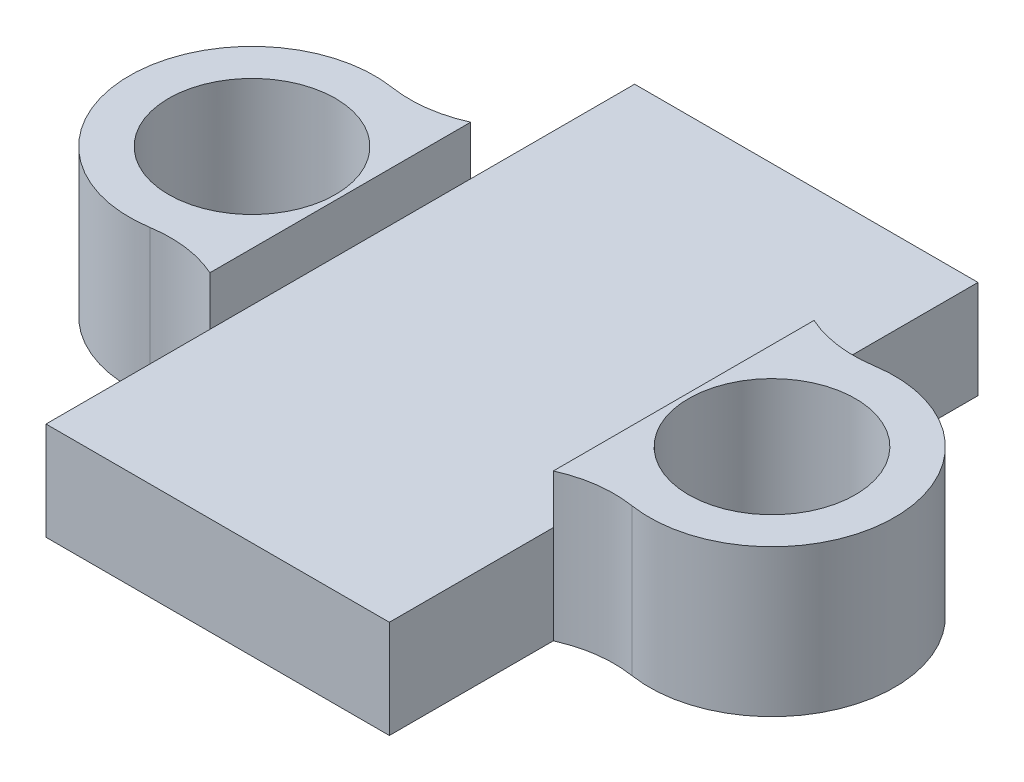
ISO-10303-21;
HEADER;
FILE_DESCRIPTION(('STEP AP214'),'2;1');
FILE_NAME('part.step','',(''),(''),'','','');
FILE_SCHEMA(('AUTOMOTIVE_DESIGN { 1 0 10303 214 1 1 1 1 }'));
ENDSEC;
DATA;
#1=APPLICATION_CONTEXT('core data for automotive mechanical design processes');
#2=APPLICATION_PROTOCOL_DEFINITION('international standard','automotive_design',2000,#1);
#3=PRODUCT_CONTEXT('',#1,'mechanical');
#4=PRODUCT('Part','Part','',(#3));
#5=PRODUCT_RELATED_PRODUCT_CATEGORY('part','',(#4));
#6=PRODUCT_DEFINITION_FORMATION('','',#4);
#7=PRODUCT_DEFINITION_CONTEXT('part definition',#1,'design');
#8=PRODUCT_DEFINITION('design','',#6,#7);
#9=PRODUCT_DEFINITION_SHAPE('','',#8);
#10=(LENGTH_UNIT() NAMED_UNIT(*) SI_UNIT(.MILLI.,.METRE.));
#11=(NAMED_UNIT(*) PLANE_ANGLE_UNIT() SI_UNIT($,.RADIAN.));
#12=(NAMED_UNIT(*) SI_UNIT($,.STERADIAN.) SOLID_ANGLE_UNIT());
#13=UNCERTAINTY_MEASURE_WITH_UNIT(LENGTH_MEASURE(1.E-05),#10,'distance_accuracy_value','');
#14=(GEOMETRIC_REPRESENTATION_CONTEXT(3) GLOBAL_UNCERTAINTY_ASSIGNED_CONTEXT((#13)) GLOBAL_UNIT_ASSIGNED_CONTEXT((#10,
#11,#12)) REPRESENTATION_CONTEXT('',''));
#15=CARTESIAN_POINT('',(0.,0.,0.));
#16=DIRECTION('',(0.,0.,1.));
#17=DIRECTION('',(1.,0.,0.));
#18=AXIS2_PLACEMENT_3D('',#15,#16,#17);
#19=CARTESIAN_POINT('',(4.52192962377324,2.,-4.93908964179011));
#20=DIRECTION('',(0.,1.,0.));
#21=DIRECTION('',(0.,0.,1.));
#22=AXIS2_PLACEMENT_3D('',#19,#20,#21);
#23=PLANE('',#22);
#24=DIRECTION('',(0.,0.,1.));
#25=VECTOR('',#24,1.);
#26=CARTESIAN_POINT('',(-3.5,2.,-6.));
#27=LINE('',#26,#25);
#28=CARTESIAN_POINT('',(-3.5,2.,-6.));
#29=VERTEX_POINT('',#28);
#30=CARTESIAN_POINT('',(-3.5,2.,-2.65749812619081));
#31=VERTEX_POINT('',#30);
#32=EDGE_CURVE('E131',#29,#31,#27,.T.);
#33=ORIENTED_EDGE('',*,*,#32,.T.);
#34=DIRECTION('',(0.,0.,-1.));
#35=VECTOR('',#34,1.);
#36=CARTESIAN_POINT('',(-3.5,2.,0.));
#37=LINE('',#36,#35);
#38=CARTESIAN_POINT('',(-3.5,2.,2.65749812619081));
#39=VERTEX_POINT('',#38);
#40=EDGE_CURVE('E126',#39,#31,#37,.T.);
#41=ORIENTED_EDGE('',*,*,#40,.F.);
#42=DIRECTION('',(0.,0.,1.));
#43=VECTOR('',#42,1.);
#44=CARTESIAN_POINT('',(-3.5,2.,6.));
#45=LINE('',#44,#43);
#46=CARTESIAN_POINT('',(-3.5,2.,6.));
#47=VERTEX_POINT('',#46);
#48=EDGE_CURVE('E119',#39,#47,#45,.T.);
#49=ORIENTED_EDGE('',*,*,#48,.T.);
#50=DIRECTION('',(1.,0.,0.));
#51=VECTOR('',#50,1.);
#52=CARTESIAN_POINT('',(-3.5,2.,6.));
#53=LINE('',#52,#51);
#54=CARTESIAN_POINT('',(3.5,2.,6.));
#55=VERTEX_POINT('',#54);
#56=EDGE_CURVE('E122',#47,#55,#53,.T.);
#57=ORIENTED_EDGE('',*,*,#56,.T.);
#58=DIRECTION('',(0.,0.,-1.));
#59=VECTOR('',#58,1.);
#60=CARTESIAN_POINT('',(3.5,2.,6.));
#61=LINE('',#60,#59);
#62=CARTESIAN_POINT('',(3.5,2.,2.65749812619081));
#63=VERTEX_POINT('',#62);
#64=EDGE_CURVE('E146',#55,#63,#61,.T.);
#65=ORIENTED_EDGE('',*,*,#64,.T.);
#66=DIRECTION('',(0.,0.,1.));
#67=VECTOR('',#66,1.);
#68=CARTESIAN_POINT('',(3.5,2.,0.));
#69=LINE('',#68,#67);
#70=CARTESIAN_POINT('',(3.5,2.,-2.65749812619081));
#71=VERTEX_POINT('',#70);
#72=EDGE_CURVE('E51',#71,#63,#69,.T.);
#73=ORIENTED_EDGE('',*,*,#72,.F.);
#74=DIRECTION('',(0.,0.,-1.));
#75=VECTOR('',#74,1.);
#76=CARTESIAN_POINT('',(3.5,2.,-6.));
#77=LINE('',#76,#75);
#78=CARTESIAN_POINT('',(3.5,2.,-6.));
#79=VERTEX_POINT('',#78);
#80=EDGE_CURVE('E175',#71,#79,#77,.T.);
#81=ORIENTED_EDGE('',*,*,#80,.T.);
#82=DIRECTION('',(-1.,0.,0.));
#83=VECTOR('',#82,1.);
#84=CARTESIAN_POINT('',(-3.5,2.,-6.));
#85=LINE('',#84,#83);
#86=EDGE_CURVE('E108',#79,#29,#85,.T.);
#87=ORIENTED_EDGE('',*,*,#86,.T.);
#88=EDGE_LOOP('',(#33,#41,#49,#57,#65,#73,#81,#87));
#89=FACE_BOUND('',#88,.T.);
#90=ADVANCED_FACE('F34',(#89),#23,.T.);
#91=CARTESIAN_POINT('',(4.52192962377324,0.,-4.93908964179011));
#92=DIRECTION('',(0.,1.,0.));
#93=DIRECTION('',(0.,0.,1.));
#94=AXIS2_PLACEMENT_3D('',#91,#92,#93);
#95=PLANE('',#94);
#96=DIRECTION('',(0.,0.,-1.));
#97=VECTOR('',#96,1.);
#98=CARTESIAN_POINT('',(3.5,0.,-6.));
#99=LINE('',#98,#97);
#100=CARTESIAN_POINT('',(3.5,0.,-2.65749812619081));
#101=VERTEX_POINT('',#100);
#102=CARTESIAN_POINT('',(3.5,0.,-6.));
#103=VERTEX_POINT('',#102);
#104=EDGE_CURVE('E152',#101,#103,#99,.T.);
#105=ORIENTED_EDGE('',*,*,#104,.F.);
#106=CARTESIAN_POINT('',(4.52192962377324,0.,-4.93908964179011));
#107=DIRECTION('',(0.,-1.,0.));
#108=DIRECTION('',(0.,0.,1.));
#109=AXIS2_PLACEMENT_3D('',#106,#107,#108);
#110=CIRCLE('',#109,2.5);
#111=CARTESIAN_POINT('',(4.91096481188662,0.,-2.46954482089505));
#112=VERTEX_POINT('',#111);
#113=EDGE_CURVE('E100',#112,#101,#110,.T.);
#114=ORIENTED_EDGE('',*,*,#113,.F.);
#115=CARTESIAN_POINT('',(5.3,0.,0.));
#116=DIRECTION('',(0.,1.,0.));
#117=DIRECTION('',(0.,0.,1.));
#118=AXIS2_PLACEMENT_3D('',#115,#116,#117);
#119=CIRCLE('',#118,2.5);
#120=CARTESIAN_POINT('',(4.91096481188662,0.,2.46954482089505));
#121=VERTEX_POINT('',#120);
#122=EDGE_CURVE('E94',#121,#112,#119,.T.);
#123=ORIENTED_EDGE('',*,*,#122,.F.);
#124=CARTESIAN_POINT('',(4.52192962377324,0.,4.93908964179011));
#125=DIRECTION('',(0.,-1.,0.));
#126=DIRECTION('',(0.,0.,-1.));
#127=AXIS2_PLACEMENT_3D('',#124,#125,#126);
#128=CIRCLE('',#127,2.5);
#129=CARTESIAN_POINT('',(3.5,0.,2.65749812619081));
#130=VERTEX_POINT('',#129);
#131=EDGE_CURVE('E171',#130,#121,#128,.T.);
#132=ORIENTED_EDGE('',*,*,#131,.F.);
#133=DIRECTION('',(0.,0.,-1.));
#134=VECTOR('',#133,1.);
#135=CARTESIAN_POINT('',(3.5,0.,6.));
#136=LINE('',#135,#134);
#137=CARTESIAN_POINT('',(3.5,0.,6.));
#138=VERTEX_POINT('',#137);
#139=EDGE_CURVE('E169',#138,#130,#136,.T.);
#140=ORIENTED_EDGE('',*,*,#139,.F.);
#141=DIRECTION('',(1.,0.,0.));
#142=VECTOR('',#141,1.);
#143=CARTESIAN_POINT('',(-3.5,0.,6.));
#144=LINE('',#143,#142);
#145=CARTESIAN_POINT('',(-3.5,0.,6.));
#146=VERTEX_POINT('',#145);
#147=EDGE_CURVE('E167',#146,#138,#144,.T.);
#148=ORIENTED_EDGE('',*,*,#147,.F.);
#149=DIRECTION('',(0.,0.,1.));
#150=VECTOR('',#149,1.);
#151=CARTESIAN_POINT('',(-3.5,0.,6.));
#152=LINE('',#151,#150);
#153=CARTESIAN_POINT('',(-3.5,0.,2.65749812619081));
#154=VERTEX_POINT('',#153);
#155=EDGE_CURVE('E137',#154,#146,#152,.T.);
#156=ORIENTED_EDGE('',*,*,#155,.F.);
#157=CARTESIAN_POINT('',(-4.52192962377324,0.,4.93908964179011));
#158=DIRECTION('',(0.,-1.,0.));
#159=DIRECTION('',(0.,0.,1.));
#160=AXIS2_PLACEMENT_3D('',#157,#158,#159);
#161=CIRCLE('',#160,2.5);
#162=CARTESIAN_POINT('',(-4.91096481188662,0.,2.46954482089505));
#163=VERTEX_POINT('',#162);
#164=EDGE_CURVE('E164',#163,#154,#161,.T.);
#165=ORIENTED_EDGE('',*,*,#164,.F.);
#166=CARTESIAN_POINT('',(-5.3,0.,0.));
#167=DIRECTION('',(0.,1.,0.));
#168=DIRECTION('',(0.,0.,-1.));
#169=AXIS2_PLACEMENT_3D('',#166,#167,#168);
#170=CIRCLE('',#169,2.5);
#171=CARTESIAN_POINT('',(-4.91096481188662,0.,-2.46954482089505));
#172=VERTEX_POINT('',#171);
#173=EDGE_CURVE('E162',#172,#163,#170,.T.);
#174=ORIENTED_EDGE('',*,*,#173,.F.);
#175=CARTESIAN_POINT('',(-4.52192962377324,0.,-4.93908964179011));
#176=DIRECTION('',(0.,-1.,0.));
#177=DIRECTION('',(0.,0.,-1.));
#178=AXIS2_PLACEMENT_3D('',#175,#176,#177);
#179=CIRCLE('',#178,2.5);
#180=CARTESIAN_POINT('',(-3.5,0.,-2.65749812619081));
#181=VERTEX_POINT('',#180);
#182=EDGE_CURVE('E160',#181,#172,#179,.T.);
#183=ORIENTED_EDGE('',*,*,#182,.F.);
#184=DIRECTION('',(0.,0.,1.));
#185=VECTOR('',#184,1.);
#186=CARTESIAN_POINT('',(-3.5,0.,-6.));
#187=LINE('',#186,#185);
#188=CARTESIAN_POINT('',(-3.5,0.,-6.));
#189=VERTEX_POINT('',#188);
#190=EDGE_CURVE('E158',#189,#181,#187,.T.);
#191=ORIENTED_EDGE('',*,*,#190,.F.);
#192=DIRECTION('',(-1.,0.,0.));
#193=VECTOR('',#192,1.);
#194=CARTESIAN_POINT('',(-3.5,0.,-6.));
#195=LINE('',#194,#193);
#196=EDGE_CURVE('E155',#103,#189,#195,.T.);
#197=ORIENTED_EDGE('',*,*,#196,.F.);
#198=EDGE_LOOP('',(#105,#114,#123,#132,#140,#148,#156,#165,#174,#183,#191,#197));
#199=FACE_BOUND('',#198,.T.);
#200=CARTESIAN_POINT('',(5.3,0.,0.));
#201=DIRECTION('',(0.,1.,0.));
#202=DIRECTION('',(0.,0.,1.));
#203=AXIS2_PLACEMENT_3D('',#200,#201,#202);
#204=CIRCLE('',#203,1.7);
#205=CARTESIAN_POINT('',(5.3,0.,1.7));
#206=VERTEX_POINT('',#205);
#207=EDGE_CURVE('E156',#206,#206,#204,.T.);
#208=ORIENTED_EDGE('',*,*,#207,.T.);
#209=EDGE_LOOP('',(#208));
#210=FACE_BOUND('',#209,.T.);
#211=CARTESIAN_POINT('',(-5.3,0.,0.));
#212=DIRECTION('',(0.,1.,0.));
#213=DIRECTION('',(0.,0.,-1.));
#214=AXIS2_PLACEMENT_3D('',#211,#212,#213);
#215=CIRCLE('',#214,1.7);
#216=CARTESIAN_POINT('',(-5.3,0.,-1.7));
#217=VERTEX_POINT('',#216);
#218=EDGE_CURVE('E260',#217,#217,#215,.T.);
#219=ORIENTED_EDGE('',*,*,#218,.T.);
#220=EDGE_LOOP('',(#219));
#221=FACE_BOUND('',#220,.T.);
#222=ADVANCED_FACE('F203',(#199,#210,#221),#95,.F.);
#223=CARTESIAN_POINT('',(3.5,2.,-6.));
#224=DIRECTION('',(-1.,0.,0.));
#225=DIRECTION('',(0.,0.,1.));
#226=AXIS2_PLACEMENT_3D('',#223,#224,#225);
#227=PLANE('',#226);
#228=ORIENTED_EDGE('',*,*,#104,.T.);
#229=DIRECTION('',(0.,-1.,0.));
#230=VECTOR('',#229,1.);
#231=CARTESIAN_POINT('',(3.5,2.,-6.));
#232=LINE('',#231,#230);
#233=EDGE_CURVE('E11',#79,#103,#232,.T.);
#234=ORIENTED_EDGE('',*,*,#233,.F.);
#235=ORIENTED_EDGE('',*,*,#80,.F.);
#236=DIRECTION('',(0.,-1.,0.));
#237=VECTOR('',#236,1.);
#238=CARTESIAN_POINT('',(3.5,2.,-2.65749812619081));
#239=LINE('',#238,#237);
#240=EDGE_CURVE('E148',#71,#101,#239,.T.);
#241=ORIENTED_EDGE('',*,*,#240,.T.);
#242=EDGE_LOOP('',(#228,#234,#235,#241));
#243=FACE_BOUND('',#242,.T.);
#244=ADVANCED_FACE('F36',(#243),#227,.F.);
#245=CARTESIAN_POINT('',(-3.5,2.,-6.));
#246=DIRECTION('',(0.,0.,1.));
#247=DIRECTION('',(1.,0.,0.));
#248=AXIS2_PLACEMENT_3D('',#245,#246,#247);
#249=PLANE('',#248);
#250=ORIENTED_EDGE('',*,*,#196,.T.);
#251=DIRECTION('',(0.,-1.,0.));
#252=VECTOR('',#251,1.);
#253=CARTESIAN_POINT('',(-3.5,2.,-6.));
#254=LINE('',#253,#252);
#255=EDGE_CURVE('E43',#29,#189,#254,.T.);
#256=ORIENTED_EDGE('',*,*,#255,.F.);
#257=ORIENTED_EDGE('',*,*,#86,.F.);
#258=ORIENTED_EDGE('',*,*,#233,.T.);
#259=EDGE_LOOP('',(#250,#256,#257,#258));
#260=FACE_BOUND('',#259,.T.);
#261=ADVANCED_FACE('F332',(#260),#249,.F.);
#262=CARTESIAN_POINT('',(-3.5,2.,-6.));
#263=DIRECTION('',(1.,0.,0.));
#264=DIRECTION('',(0.,0.,-1.));
#265=AXIS2_PLACEMENT_3D('',#262,#263,#264);
#266=PLANE('',#265);
#267=ORIENTED_EDGE('',*,*,#190,.T.);
#268=DIRECTION('',(0.,-1.,0.));
#269=VECTOR('',#268,1.);
#270=CARTESIAN_POINT('',(-3.5,2.,-2.65749812619081));
#271=LINE('',#270,#269);
#272=EDGE_CURVE('E192',#31,#181,#271,.T.);
#273=ORIENTED_EDGE('',*,*,#272,.F.);
#274=ORIENTED_EDGE('',*,*,#32,.F.);
#275=ORIENTED_EDGE('',*,*,#255,.T.);
#276=EDGE_LOOP('',(#267,#273,#274,#275));
#277=FACE_BOUND('',#276,.T.);
#278=ADVANCED_FACE('F198',(#277),#266,.F.);
#279=CARTESIAN_POINT('',(-4.52192962377324,2.,-4.93908964179011));
#280=DIRECTION('',(0.,-1.,0.));
#281=DIRECTION('',(0.,0.,-1.));
#282=AXIS2_PLACEMENT_3D('',#279,#280,#281);
#283=CYLINDRICAL_SURFACE('',#282,2.5);
#284=ORIENTED_EDGE('',*,*,#182,.T.);
#285=DIRECTION('',(0.,-1.,0.));
#286=VECTOR('',#285,1.);
#287=CARTESIAN_POINT('',(-4.91096481188662,2.,-2.46954482089505));
#288=LINE('',#287,#286);
#289=CARTESIAN_POINT('',(-4.91096481188661,3.,-2.46954482089505));
#290=VERTEX_POINT('',#289);
#291=EDGE_CURVE('E189',#290,#172,#288,.T.);
#292=ORIENTED_EDGE('',*,*,#291,.F.);
#293=CARTESIAN_POINT('',(-4.52192962377324,3.,-4.93908964179011));
#294=DIRECTION('',(0.,1.,0.));
#295=DIRECTION('',(0.,0.,1.));
#296=AXIS2_PLACEMENT_3D('',#293,#294,#295);
#297=CIRCLE('',#296,2.5);
#298=CARTESIAN_POINT('',(-3.5,3.,-2.65749812619081));
#299=VERTEX_POINT('',#298);
#300=EDGE_CURVE('E227',#299,#290,#297,.F.);
#301=ORIENTED_EDGE('',*,*,#300,.F.);
#302=DIRECTION('',(0.,-1.,0.));
#303=VECTOR('',#302,1.);
#304=CARTESIAN_POINT('',(-3.5,3.,-2.65749812619081));
#305=LINE('',#304,#303);
#306=EDGE_CURVE('E226',#299,#31,#305,.T.);
#307=ORIENTED_EDGE('',*,*,#306,.T.);
#308=ORIENTED_EDGE('',*,*,#272,.T.);
#309=EDGE_LOOP('',(#284,#292,#301,#307,#308));
#310=FACE_BOUND('',#309,.T.);
#311=ADVANCED_FACE('F209',(#310),#283,.F.);
#312=CARTESIAN_POINT('',(-5.3,2.,0.));
#313=DIRECTION('',(0.,-1.,0.));
#314=DIRECTION('',(0.,0.,-1.));
#315=AXIS2_PLACEMENT_3D('',#312,#313,#314);
#316=CYLINDRICAL_SURFACE('',#315,2.5);
#317=ORIENTED_EDGE('',*,*,#173,.T.);
#318=DIRECTION('',(0.,-1.,0.));
#319=VECTOR('',#318,1.);
#320=CARTESIAN_POINT('',(-4.91096481188662,2.,2.46954482089505));
#321=LINE('',#320,#319);
#322=CARTESIAN_POINT('',(-4.91096481188662,3.,2.46954482089505));
#323=VERTEX_POINT('',#322);
#324=EDGE_CURVE('E186',#323,#163,#321,.T.);
#325=ORIENTED_EDGE('',*,*,#324,.F.);
#326=CARTESIAN_POINT('',(-5.3,3.,0.));
#327=DIRECTION('',(0.,1.,0.));
#328=DIRECTION('',(0.,0.,1.));
#329=AXIS2_PLACEMENT_3D('',#326,#327,#328);
#330=CIRCLE('',#329,2.5);
#331=EDGE_CURVE('E219',#290,#323,#330,.T.);
#332=ORIENTED_EDGE('',*,*,#331,.F.);
#333=ORIENTED_EDGE('',*,*,#291,.T.);
#334=EDGE_LOOP('',(#317,#325,#332,#333));
#335=FACE_BOUND('',#334,.T.);
#336=ADVANCED_FACE('F216',(#335),#316,.T.);
#337=CARTESIAN_POINT('',(-4.52192962377324,2.,4.93908964179011));
#338=DIRECTION('',(0.,-1.,0.));
#339=DIRECTION('',(0.,0.,-1.));
#340=AXIS2_PLACEMENT_3D('',#337,#338,#339);
#341=CYLINDRICAL_SURFACE('',#340,2.5);
#342=ORIENTED_EDGE('',*,*,#164,.T.);
#343=DIRECTION('',(0.,-1.,0.));
#344=VECTOR('',#343,1.);
#345=CARTESIAN_POINT('',(-3.5,2.,2.65749812619081));
#346=LINE('',#345,#344);
#347=EDGE_CURVE('E140',#39,#154,#346,.T.);
#348=ORIENTED_EDGE('',*,*,#347,.F.);
#349=DIRECTION('',(0.,-1.,0.));
#350=VECTOR('',#349,1.);
#351=CARTESIAN_POINT('',(-3.5,3.,2.65749812619081));
#352=LINE('',#351,#350);
#353=CARTESIAN_POINT('',(-3.5,3.,2.65749812619081));
#354=VERTEX_POINT('',#353);
#355=EDGE_CURVE('E229',#354,#39,#352,.T.);
#356=ORIENTED_EDGE('',*,*,#355,.F.);
#357=CARTESIAN_POINT('',(-4.52192962377324,3.,4.93908964179011));
#358=DIRECTION('',(0.,1.,0.));
#359=DIRECTION('',(0.,0.,1.));
#360=AXIS2_PLACEMENT_3D('',#357,#358,#359);
#361=CIRCLE('',#360,2.5);
#362=EDGE_CURVE('E275',#323,#354,#361,.F.);
#363=ORIENTED_EDGE('',*,*,#362,.F.);
#364=ORIENTED_EDGE('',*,*,#324,.T.);
#365=EDGE_LOOP('',(#342,#348,#356,#363,#364));
#366=FACE_BOUND('',#365,.T.);
#367=ADVANCED_FACE('F323',(#366),#341,.F.);
#368=CARTESIAN_POINT('',(-3.5,2.,6.));
#369=DIRECTION('',(1.,0.,0.));
#370=DIRECTION('',(0.,0.,-1.));
#371=AXIS2_PLACEMENT_3D('',#368,#369,#370);
#372=PLANE('',#371);
#373=ORIENTED_EDGE('',*,*,#155,.T.);
#374=DIRECTION('',(0.,-1.,0.));
#375=VECTOR('',#374,1.);
#376=CARTESIAN_POINT('',(-3.5,2.,6.));
#377=LINE('',#376,#375);
#378=EDGE_CURVE('E134',#47,#146,#377,.T.);
#379=ORIENTED_EDGE('',*,*,#378,.F.);
#380=ORIENTED_EDGE('',*,*,#48,.F.);
#381=ORIENTED_EDGE('',*,*,#347,.T.);
#382=EDGE_LOOP('',(#373,#379,#380,#381));
#383=FACE_BOUND('',#382,.T.);
#384=ADVANCED_FACE('F135',(#383),#372,.F.);
#385=CARTESIAN_POINT('',(-3.5,2.,6.));
#386=DIRECTION('',(0.,0.,-1.));
#387=DIRECTION('',(-1.,0.,0.));
#388=AXIS2_PLACEMENT_3D('',#385,#386,#387);
#389=PLANE('',#388);
#390=ORIENTED_EDGE('',*,*,#147,.T.);
#391=DIRECTION('',(0.,-1.,0.));
#392=VECTOR('',#391,1.);
#393=CARTESIAN_POINT('',(3.5,2.,6.));
#394=LINE('',#393,#392);
#395=EDGE_CURVE('E141',#55,#138,#394,.T.);
#396=ORIENTED_EDGE('',*,*,#395,.F.);
#397=ORIENTED_EDGE('',*,*,#56,.F.);
#398=ORIENTED_EDGE('',*,*,#378,.T.);
#399=EDGE_LOOP('',(#390,#396,#397,#398));
#400=FACE_BOUND('',#399,.T.);
#401=ADVANCED_FACE('F143',(#400),#389,.F.);
#402=CARTESIAN_POINT('',(3.5,2.,6.));
#403=DIRECTION('',(-1.,0.,0.));
#404=DIRECTION('',(0.,0.,1.));
#405=AXIS2_PLACEMENT_3D('',#402,#403,#404);
#406=PLANE('',#405);
#407=ORIENTED_EDGE('',*,*,#139,.T.);
#408=DIRECTION('',(0.,-1.,0.));
#409=VECTOR('',#408,1.);
#410=CARTESIAN_POINT('',(3.5,2.,2.65749812619081));
#411=LINE('',#410,#409);
#412=EDGE_CURVE('E181',#63,#130,#411,.T.);
#413=ORIENTED_EDGE('',*,*,#412,.F.);
#414=ORIENTED_EDGE('',*,*,#64,.F.);
#415=ORIENTED_EDGE('',*,*,#395,.T.);
#416=EDGE_LOOP('',(#407,#413,#414,#415));
#417=FACE_BOUND('',#416,.T.);
#418=ADVANCED_FACE('F314',(#417),#406,.F.);
#419=CARTESIAN_POINT('',(4.52192962377324,2.,4.93908964179011));
#420=DIRECTION('',(0.,-1.,0.));
#421=DIRECTION('',(0.,0.,-1.));
#422=AXIS2_PLACEMENT_3D('',#419,#420,#421);
#423=CYLINDRICAL_SURFACE('',#422,2.5);
#424=ORIENTED_EDGE('',*,*,#131,.T.);
#425=DIRECTION('',(0.,-1.,0.));
#426=VECTOR('',#425,1.);
#427=CARTESIAN_POINT('',(4.91096481188662,2.,2.46954482089505));
#428=LINE('',#427,#426);
#429=CARTESIAN_POINT('',(4.91096481188662,3.,2.46954482089505));
#430=VERTEX_POINT('',#429);
#431=EDGE_CURVE('E179',#430,#121,#428,.T.);
#432=ORIENTED_EDGE('',*,*,#431,.F.);
#433=CARTESIAN_POINT('',(4.52192962377324,3.,4.93908964179011));
#434=DIRECTION('',(0.,1.,0.));
#435=DIRECTION('',(0.,0.,1.));
#436=AXIS2_PLACEMENT_3D('',#433,#434,#435);
#437=CIRCLE('',#436,2.5);
#438=CARTESIAN_POINT('',(3.5,3.,2.65749812619081));
#439=VERTEX_POINT('',#438);
#440=EDGE_CURVE('E247',#439,#430,#437,.F.);
#441=ORIENTED_EDGE('',*,*,#440,.F.);
#442=DIRECTION('',(0.,-1.,0.));
#443=VECTOR('',#442,1.);
#444=CARTESIAN_POINT('',(3.5,3.,2.65749812619081));
#445=LINE('',#444,#443);
#446=EDGE_CURVE('E253',#439,#63,#445,.T.);
#447=ORIENTED_EDGE('',*,*,#446,.T.);
#448=ORIENTED_EDGE('',*,*,#412,.T.);
#449=EDGE_LOOP('',(#424,#432,#441,#447,#448));
#450=FACE_BOUND('',#449,.T.);
#451=ADVANCED_FACE('F311',(#450),#423,.F.);
#452=CARTESIAN_POINT('',(5.3,2.,0.));
#453=DIRECTION('',(0.,-1.,0.));
#454=DIRECTION('',(0.,0.,-1.));
#455=AXIS2_PLACEMENT_3D('',#452,#453,#454);
#456=CYLINDRICAL_SURFACE('',#455,2.5);
#457=ORIENTED_EDGE('',*,*,#122,.T.);
#458=DIRECTION('',(0.,-1.,0.));
#459=VECTOR('',#458,1.);
#460=CARTESIAN_POINT('',(4.91096481188662,2.,-2.46954482089505));
#461=LINE('',#460,#459);
#462=CARTESIAN_POINT('',(4.91096481188662,3.,-2.46954482089505));
#463=VERTEX_POINT('',#462);
#464=EDGE_CURVE('E177',#463,#112,#461,.T.);
#465=ORIENTED_EDGE('',*,*,#464,.F.);
#466=CARTESIAN_POINT('',(5.3,3.,0.));
#467=DIRECTION('',(0.,1.,0.));
#468=DIRECTION('',(0.,0.,1.));
#469=AXIS2_PLACEMENT_3D('',#466,#467,#468);
#470=CIRCLE('',#469,2.5);
#471=EDGE_CURVE('E250',#430,#463,#470,.T.);
#472=ORIENTED_EDGE('',*,*,#471,.F.);
#473=ORIENTED_EDGE('',*,*,#431,.T.);
#474=EDGE_LOOP('',(#457,#465,#472,#473));
#475=FACE_BOUND('',#474,.T.);
#476=ADVANCED_FACE('F308',(#475),#456,.T.);
#477=CARTESIAN_POINT('',(4.52192962377324,2.,-4.93908964179011));
#478=DIRECTION('',(0.,-1.,0.));
#479=DIRECTION('',(0.,0.,-1.));
#480=AXIS2_PLACEMENT_3D('',#477,#478,#479);
#481=CYLINDRICAL_SURFACE('',#480,2.5);
#482=ORIENTED_EDGE('',*,*,#113,.T.);
#483=ORIENTED_EDGE('',*,*,#240,.F.);
#484=DIRECTION('',(0.,-1.,0.));
#485=VECTOR('',#484,1.);
#486=CARTESIAN_POINT('',(3.5,3.,-2.65749812619081));
#487=LINE('',#486,#485);
#488=CARTESIAN_POINT('',(3.5,3.,-2.65749812619081));
#489=VERTEX_POINT('',#488);
#490=EDGE_CURVE('E257',#489,#71,#487,.T.);
#491=ORIENTED_EDGE('',*,*,#490,.F.);
#492=CARTESIAN_POINT('',(4.52192962377324,3.,-4.93908964179011));
#493=DIRECTION('',(0.,1.,0.));
#494=DIRECTION('',(0.,0.,1.));
#495=AXIS2_PLACEMENT_3D('',#492,#493,#494);
#496=CIRCLE('',#495,2.5);
#497=EDGE_CURVE('E241',#463,#489,#496,.F.);
#498=ORIENTED_EDGE('',*,*,#497,.F.);
#499=ORIENTED_EDGE('',*,*,#464,.T.);
#500=EDGE_LOOP('',(#482,#483,#491,#498,#499));
#501=FACE_BOUND('',#500,.T.);
#502=ADVANCED_FACE('F295',(#501),#481,.F.);
#503=CARTESIAN_POINT('',(5.3,2.,0.));
#504=DIRECTION('',(0.,-1.,0.));
#505=DIRECTION('',(0.,0.,-1.));
#506=AXIS2_PLACEMENT_3D('',#503,#504,#505);
#507=CYLINDRICAL_SURFACE('',#506,1.7);
#508=ORIENTED_EDGE('',*,*,#207,.F.);
#509=EDGE_LOOP('',(#508));
#510=FACE_BOUND('',#509,.T.);
#511=CARTESIAN_POINT('',(5.3,3.,0.));
#512=DIRECTION('',(0.,1.,0.));
#513=DIRECTION('',(0.,0.,1.));
#514=AXIS2_PLACEMENT_3D('',#511,#512,#513);
#515=CIRCLE('',#514,1.7);
#516=CARTESIAN_POINT('',(5.3,3.,1.7));
#517=VERTEX_POINT('',#516);
#518=EDGE_CURVE('E238',#517,#517,#515,.F.);
#519=ORIENTED_EDGE('',*,*,#518,.F.);
#520=EDGE_LOOP('',(#519));
#521=FACE_BOUND('',#520,.T.);
#522=ADVANCED_FACE('F285',(#510,#521),#507,.F.);
#523=CARTESIAN_POINT('',(-5.3,2.,0.));
#524=DIRECTION('',(0.,-1.,0.));
#525=DIRECTION('',(0.,0.,-1.));
#526=AXIS2_PLACEMENT_3D('',#523,#524,#525);
#527=CYLINDRICAL_SURFACE('',#526,1.7);
#528=ORIENTED_EDGE('',*,*,#218,.F.);
#529=EDGE_LOOP('',(#528));
#530=FACE_BOUND('',#529,.T.);
#531=CARTESIAN_POINT('',(-5.3,3.,0.));
#532=DIRECTION('',(0.,1.,0.));
#533=DIRECTION('',(0.,0.,1.));
#534=AXIS2_PLACEMENT_3D('',#531,#532,#533);
#535=CIRCLE('',#534,1.7);
#536=CARTESIAN_POINT('',(-5.3,3.,1.7));
#537=VERTEX_POINT('',#536);
#538=EDGE_CURVE('E235',#537,#537,#535,.F.);
#539=ORIENTED_EDGE('',*,*,#538,.F.);
#540=EDGE_LOOP('',(#539));
#541=FACE_BOUND('',#540,.T.);
#542=ADVANCED_FACE('F282',(#530,#541),#527,.F.);
#543=CARTESIAN_POINT('',(3.5,3.,0.));
#544=DIRECTION('',(1.,0.,0.));
#545=DIRECTION('',(0.,0.,-1.));
#546=AXIS2_PLACEMENT_3D('',#543,#544,#545);
#547=PLANE('',#546);
#548=ORIENTED_EDGE('',*,*,#72,.T.);
#549=ORIENTED_EDGE('',*,*,#446,.F.);
#550=DIRECTION('',(0.,0.,1.));
#551=VECTOR('',#550,1.);
#552=CARTESIAN_POINT('',(3.5,3.,0.));
#553=LINE('',#552,#551);
#554=EDGE_CURVE('E244',#489,#439,#553,.T.);
#555=ORIENTED_EDGE('',*,*,#554,.F.);
#556=ORIENTED_EDGE('',*,*,#490,.T.);
#557=EDGE_LOOP('',(#548,#549,#555,#556));
#558=FACE_BOUND('',#557,.T.);
#559=ADVANCED_FACE('F284',(#558),#547,.F.);
#560=CARTESIAN_POINT('',(0.,3.,0.));
#561=DIRECTION('',(0.,1.,0.));
#562=DIRECTION('',(0.,0.,1.));
#563=AXIS2_PLACEMENT_3D('',#560,#561,#562);
#564=PLANE('',#563);
#565=ORIENTED_EDGE('',*,*,#518,.T.);
#566=EDGE_LOOP('',(#565));
#567=FACE_BOUND('',#566,.T.);
#568=ORIENTED_EDGE('',*,*,#497,.T.);
#569=ORIENTED_EDGE('',*,*,#554,.T.);
#570=ORIENTED_EDGE('',*,*,#440,.T.);
#571=ORIENTED_EDGE('',*,*,#471,.T.);
#572=EDGE_LOOP('',(#568,#569,#570,#571));
#573=FACE_BOUND('',#572,.T.);
#574=ADVANCED_FACE('F292',(#567,#573),#564,.T.);
#575=CARTESIAN_POINT('',(-3.5,3.,0.));
#576=DIRECTION('',(-1.,0.,0.));
#577=DIRECTION('',(0.,0.,1.));
#578=AXIS2_PLACEMENT_3D('',#575,#576,#577);
#579=PLANE('',#578);
#580=ORIENTED_EDGE('',*,*,#40,.T.);
#581=ORIENTED_EDGE('',*,*,#306,.F.);
#582=DIRECTION('',(0.,0.,-1.));
#583=VECTOR('',#582,1.);
#584=CARTESIAN_POINT('',(-3.5,3.,0.));
#585=LINE('',#584,#583);
#586=EDGE_CURVE('E231',#354,#299,#585,.T.);
#587=ORIENTED_EDGE('',*,*,#586,.F.);
#588=ORIENTED_EDGE('',*,*,#355,.T.);
#589=EDGE_LOOP('',(#580,#581,#587,#588));
#590=FACE_BOUND('',#589,.T.);
#591=ADVANCED_FACE('F268',(#590),#579,.F.);
#592=CARTESIAN_POINT('',(0.,3.,0.));
#593=DIRECTION('',(0.,1.,0.));
#594=DIRECTION('',(0.,0.,1.));
#595=AXIS2_PLACEMENT_3D('',#592,#593,#594);
#596=PLANE('',#595);
#597=ORIENTED_EDGE('',*,*,#538,.T.);
#598=EDGE_LOOP('',(#597));
#599=FACE_BOUND('',#598,.T.);
#600=ORIENTED_EDGE('',*,*,#362,.T.);
#601=ORIENTED_EDGE('',*,*,#586,.T.);
#602=ORIENTED_EDGE('',*,*,#300,.T.);
#603=ORIENTED_EDGE('',*,*,#331,.T.);
#604=EDGE_LOOP('',(#600,#601,#602,#603));
#605=FACE_BOUND('',#604,.T.);
#606=ADVANCED_FACE('F274',(#599,#605),#596,.T.);
#607=CLOSED_SHELL('',(#90,#222,#244,#261,#278,#311,#336,#367,#384,#401,#418,#451,#476,#502,#522,
#542,#559,#574,#591,#606));
#608=MANIFOLD_SOLID_BREP('B2',#607);
#609=ADVANCED_BREP_SHAPE_REPRESENTATION('',(#18,#608),#14);
#610=SHAPE_DEFINITION_REPRESENTATION(#9,#609);
ENDSEC;
END-ISO-10303-21;
